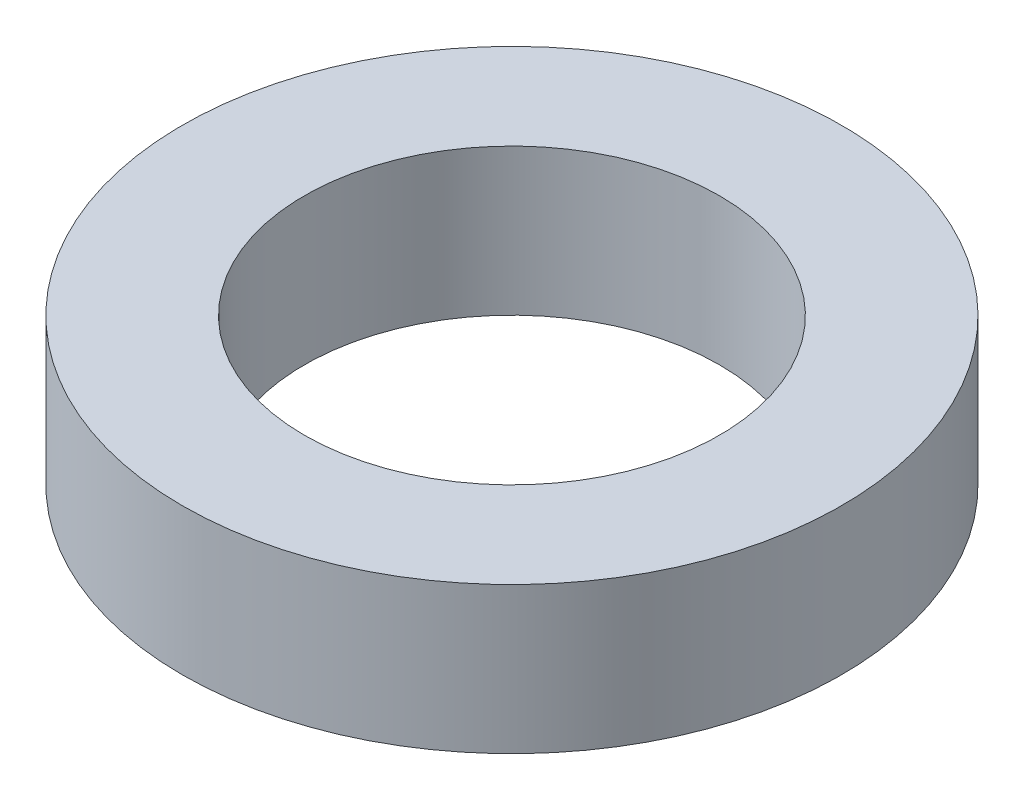
ISO-10303-21;
HEADER;
FILE_DESCRIPTION(('STEP AP214'),'2;1');
FILE_NAME('part.step','',(''),(''),'','','');
FILE_SCHEMA(('AUTOMOTIVE_DESIGN { 1 0 10303 214 1 1 1 1 }'));
ENDSEC;
DATA;
#1=APPLICATION_CONTEXT('core data for automotive mechanical design processes');
#2=APPLICATION_PROTOCOL_DEFINITION('international standard','automotive_design',2000,#1);
#3=PRODUCT_CONTEXT('',#1,'mechanical');
#4=PRODUCT('Part','Part','',(#3));
#5=PRODUCT_RELATED_PRODUCT_CATEGORY('part','',(#4));
#6=PRODUCT_DEFINITION_FORMATION('','',#4);
#7=PRODUCT_DEFINITION_CONTEXT('part definition',#1,'design');
#8=PRODUCT_DEFINITION('design','',#6,#7);
#9=PRODUCT_DEFINITION_SHAPE('','',#8);
#10=(LENGTH_UNIT() NAMED_UNIT(*) SI_UNIT(.MILLI.,.METRE.));
#11=(NAMED_UNIT(*) PLANE_ANGLE_UNIT() SI_UNIT($,.RADIAN.));
#12=(NAMED_UNIT(*) SI_UNIT($,.STERADIAN.) SOLID_ANGLE_UNIT());
#13=UNCERTAINTY_MEASURE_WITH_UNIT(LENGTH_MEASURE(1.E-05),#10,'distance_accuracy_value','');
#14=(GEOMETRIC_REPRESENTATION_CONTEXT(3) GLOBAL_UNCERTAINTY_ASSIGNED_CONTEXT((#13)) GLOBAL_UNIT_ASSIGNED_CONTEXT((#10,
#11,#12)) REPRESENTATION_CONTEXT('',''));
#15=CARTESIAN_POINT('',(0.,0.,0.));
#16=DIRECTION('',(0.,0.,1.));
#17=DIRECTION('',(1.,0.,0.));
#18=AXIS2_PLACEMENT_3D('',#15,#16,#17);
#19=CARTESIAN_POINT('',(0.,30.,0.));
#20=DIRECTION('',(0.,-1.,0.));
#21=DIRECTION('',(0.,0.,-1.));
#22=AXIS2_PLACEMENT_3D('',#19,#20,#21);
#23=CYLINDRICAL_SURFACE('',#22,67.5);
#24=CARTESIAN_POINT('',(0.,30.,0.));
#25=DIRECTION('',(0.,1.,0.));
#26=DIRECTION('',(0.,0.,1.));
#27=AXIS2_PLACEMENT_3D('',#24,#25,#26);
#28=CIRCLE('',#27,67.5);
#29=CARTESIAN_POINT('',(0.,30.,67.5));
#30=VERTEX_POINT('',#29);
#31=EDGE_CURVE('E10',#30,#30,#28,.T.);
#32=ORIENTED_EDGE('',*,*,#31,.F.);
#33=EDGE_LOOP('',(#32));
#34=FACE_BOUND('',#33,.T.);
#35=CARTESIAN_POINT('',(0.,0.,0.));
#36=DIRECTION('',(0.,1.,0.));
#37=DIRECTION('',(0.,0.,1.));
#38=AXIS2_PLACEMENT_3D('',#35,#36,#37);
#39=CIRCLE('',#38,67.5);
#40=CARTESIAN_POINT('',(0.,0.,67.5));
#41=VERTEX_POINT('',#40);
#42=EDGE_CURVE('E37',#41,#41,#39,.T.);
#43=ORIENTED_EDGE('',*,*,#42,.T.);
#44=EDGE_LOOP('',(#43));
#45=FACE_BOUND('',#44,.T.);
#46=ADVANCED_FACE('F40',(#34,#45),#23,.T.);
#47=CARTESIAN_POINT('',(0.,30.,0.));
#48=DIRECTION('',(0.,1.,0.));
#49=DIRECTION('',(0.,0.,1.));
#50=AXIS2_PLACEMENT_3D('',#47,#48,#49);
#51=PLANE('',#50);
#52=CARTESIAN_POINT('',(0.,30.,0.));
#53=DIRECTION('',(0.,1.,0.));
#54=DIRECTION('',(0.,0.,1.));
#55=AXIS2_PLACEMENT_3D('',#52,#53,#54);
#56=CIRCLE('',#55,42.5);
#57=CARTESIAN_POINT('',(0.,30.,42.5));
#58=VERTEX_POINT('',#57);
#59=EDGE_CURVE('E50',#58,#58,#56,.T.);
#60=ORIENTED_EDGE('',*,*,#59,.F.);
#61=EDGE_LOOP('',(#60));
#62=FACE_BOUND('',#61,.T.);
#63=ORIENTED_EDGE('',*,*,#31,.T.);
#64=EDGE_LOOP('',(#63));
#65=FACE_BOUND('',#64,.T.);
#66=ADVANCED_FACE('F59',(#62,#65),#51,.T.);
#67=CARTESIAN_POINT('',(0.,0.,0.));
#68=DIRECTION('',(0.,1.,0.));
#69=DIRECTION('',(0.,0.,1.));
#70=AXIS2_PLACEMENT_3D('',#67,#68,#69);
#71=PLANE('',#70);
#72=CARTESIAN_POINT('',(0.,0.,0.));
#73=DIRECTION('',(0.,1.,0.));
#74=DIRECTION('',(0.,0.,1.));
#75=AXIS2_PLACEMENT_3D('',#72,#73,#74);
#76=CIRCLE('',#75,42.5);
#77=CARTESIAN_POINT('',(0.,0.,42.5));
#78=VERTEX_POINT('',#77);
#79=EDGE_CURVE('E47',#78,#78,#76,.T.);
#80=ORIENTED_EDGE('',*,*,#79,.T.);
#81=EDGE_LOOP('',(#80));
#82=FACE_BOUND('',#81,.T.);
#83=ORIENTED_EDGE('',*,*,#42,.F.);
#84=EDGE_LOOP('',(#83));
#85=FACE_BOUND('',#84,.T.);
#86=ADVANCED_FACE('F58',(#82,#85),#71,.F.);
#87=CARTESIAN_POINT('',(0.,30.,0.));
#88=DIRECTION('',(0.,-1.,0.));
#89=DIRECTION('',(0.,0.,-1.));
#90=AXIS2_PLACEMENT_3D('',#87,#88,#89);
#91=CYLINDRICAL_SURFACE('',#90,42.5);
#92=ORIENTED_EDGE('',*,*,#59,.T.);
#93=EDGE_LOOP('',(#92));
#94=FACE_BOUND('',#93,.T.);
#95=ORIENTED_EDGE('',*,*,#79,.F.);
#96=EDGE_LOOP('',(#95));
#97=FACE_BOUND('',#96,.T.);
#98=ADVANCED_FACE('F54',(#94,#97),#91,.F.);
#99=CLOSED_SHELL('',(#46,#66,#86,#98));
#100=MANIFOLD_SOLID_BREP('B2',#99);
#101=ADVANCED_BREP_SHAPE_REPRESENTATION('',(#18,#100),#14);
#102=SHAPE_DEFINITION_REPRESENTATION(#9,#101);
ENDSEC;
END-ISO-10303-21;
